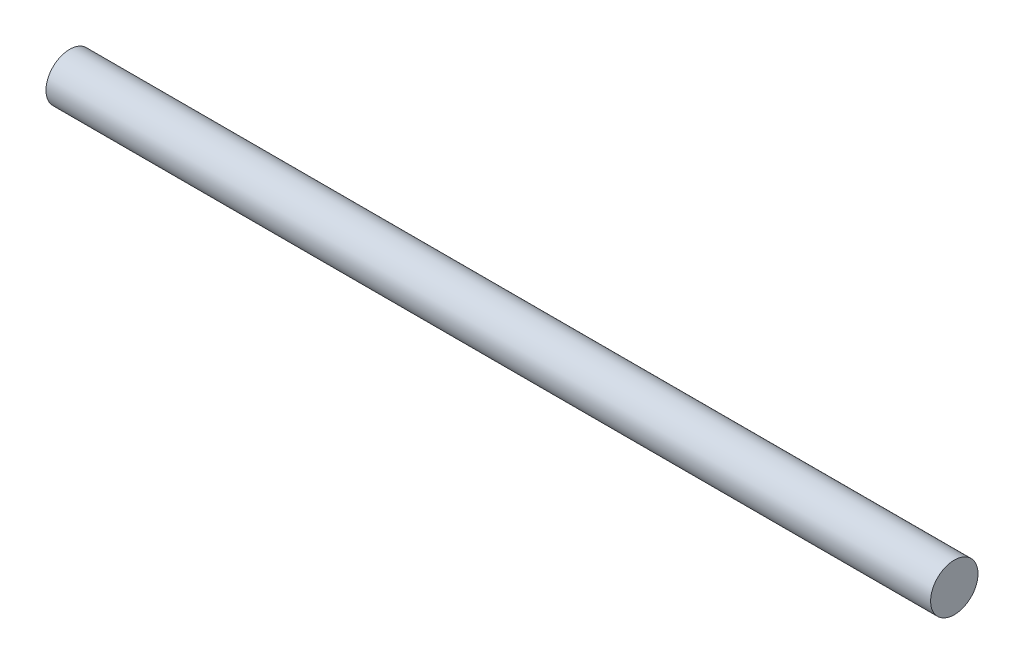
ISO-10303-21;
HEADER;
FILE_DESCRIPTION(('STEP AP214'),'2;1');
FILE_NAME('part.step','',(''),(''),'','','');
FILE_SCHEMA(('AUTOMOTIVE_DESIGN { 1 0 10303 214 1 1 1 1 }'));
ENDSEC;
DATA;
#1=APPLICATION_CONTEXT('core data for automotive mechanical design processes');
#2=APPLICATION_PROTOCOL_DEFINITION('international standard','automotive_design',2000,#1);
#3=PRODUCT_CONTEXT('',#1,'mechanical');
#4=PRODUCT('Part','Part','',(#3));
#5=PRODUCT_RELATED_PRODUCT_CATEGORY('part','',(#4));
#6=PRODUCT_DEFINITION_FORMATION('','',#4);
#7=PRODUCT_DEFINITION_CONTEXT('part definition',#1,'design');
#8=PRODUCT_DEFINITION('design','',#6,#7);
#9=PRODUCT_DEFINITION_SHAPE('','',#8);
#10=(LENGTH_UNIT() NAMED_UNIT(*) SI_UNIT(.MILLI.,.METRE.));
#11=(NAMED_UNIT(*) PLANE_ANGLE_UNIT() SI_UNIT($,.RADIAN.));
#12=(NAMED_UNIT(*) SI_UNIT($,.STERADIAN.) SOLID_ANGLE_UNIT());
#13=UNCERTAINTY_MEASURE_WITH_UNIT(LENGTH_MEASURE(1.E-05),#10,'distance_accuracy_value','');
#14=(GEOMETRIC_REPRESENTATION_CONTEXT(3) GLOBAL_UNCERTAINTY_ASSIGNED_CONTEXT((#13)) GLOBAL_UNIT_ASSIGNED_CONTEXT((#10,
#11,#12)) REPRESENTATION_CONTEXT('',''));
#15=CARTESIAN_POINT('',(0.,0.,0.));
#16=DIRECTION('',(0.,0.,1.));
#17=DIRECTION('',(1.,0.,0.));
#18=AXIS2_PLACEMENT_3D('',#15,#16,#17);
#19=CARTESIAN_POINT('',(560.,0.,0.));
#20=DIRECTION('',(-1.,0.,0.));
#21=DIRECTION('',(0.,0.,1.));
#22=AXIS2_PLACEMENT_3D('',#19,#20,#21);
#23=CYLINDRICAL_SURFACE('',#22,15.);
#24=CARTESIAN_POINT('',(560.,0.,0.));
#25=DIRECTION('',(1.,0.,0.));
#26=DIRECTION('',(0.,0.,-1.));
#27=AXIS2_PLACEMENT_3D('',#24,#25,#26);
#28=CIRCLE('',#27,15.);
#29=CARTESIAN_POINT('',(560.,0.,-15.));
#30=VERTEX_POINT('',#29);
#31=EDGE_CURVE('E10',#30,#30,#28,.T.);
#32=ORIENTED_EDGE('',*,*,#31,.F.);
#33=EDGE_LOOP('',(#32));
#34=FACE_BOUND('',#33,.T.);
#35=CARTESIAN_POINT('',(0.,0.,0.));
#36=DIRECTION('',(1.,0.,0.));
#37=DIRECTION('',(0.,0.,-1.));
#38=AXIS2_PLACEMENT_3D('',#35,#36,#37);
#39=CIRCLE('',#38,15.);
#40=CARTESIAN_POINT('',(0.,0.,-15.));
#41=VERTEX_POINT('',#40);
#42=EDGE_CURVE('E40',#41,#41,#39,.T.);
#43=ORIENTED_EDGE('',*,*,#42,.T.);
#44=EDGE_LOOP('',(#43));
#45=FACE_BOUND('',#44,.T.);
#46=ADVANCED_FACE('F37',(#34,#45),#23,.T.);
#47=CARTESIAN_POINT('',(560.,0.,0.));
#48=DIRECTION('',(1.,0.,0.));
#49=DIRECTION('',(0.,0.,-1.));
#50=AXIS2_PLACEMENT_3D('',#47,#48,#49);
#51=PLANE('',#50);
#52=ORIENTED_EDGE('',*,*,#31,.T.);
#53=EDGE_LOOP('',(#52));
#54=FACE_BOUND('',#53,.T.);
#55=ADVANCED_FACE('F54',(#54),#51,.T.);
#56=CARTESIAN_POINT('',(0.,0.,0.));
#57=DIRECTION('',(1.,0.,0.));
#58=DIRECTION('',(0.,0.,-1.));
#59=AXIS2_PLACEMENT_3D('',#56,#57,#58);
#60=PLANE('',#59);
#61=ORIENTED_EDGE('',*,*,#42,.F.);
#62=EDGE_LOOP('',(#61));
#63=FACE_BOUND('',#62,.T.);
#64=ADVANCED_FACE('F52',(#63),#60,.F.);
#65=CLOSED_SHELL('',(#46,#55,#64));
#66=MANIFOLD_SOLID_BREP('B2',#65);
#67=ADVANCED_BREP_SHAPE_REPRESENTATION('',(#18,#66),#14);
#68=SHAPE_DEFINITION_REPRESENTATION(#9,#67);
ENDSEC;
END-ISO-10303-21;
